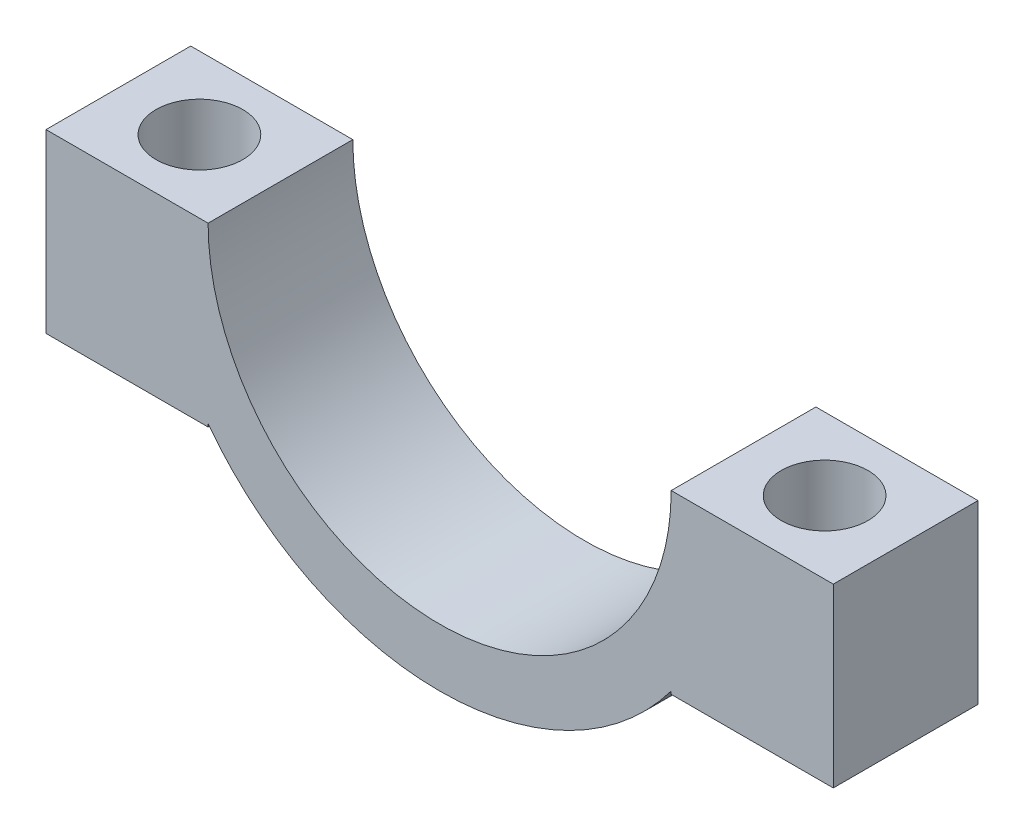
ISO-10303-21;
HEADER;
FILE_DESCRIPTION(('STEP AP214'),'2;1');
FILE_NAME('part.step','',(''),(''),'','','');
FILE_SCHEMA(('AUTOMOTIVE_DESIGN { 1 0 10303 214 1 1 1 1 }'));
ENDSEC;
DATA;
#1=APPLICATION_CONTEXT('core data for automotive mechanical design processes');
#2=APPLICATION_PROTOCOL_DEFINITION('international standard','automotive_design',2000,#1);
#3=PRODUCT_CONTEXT('',#1,'mechanical');
#4=PRODUCT('Part','Part','',(#3));
#5=PRODUCT_RELATED_PRODUCT_CATEGORY('part','',(#4));
#6=PRODUCT_DEFINITION_FORMATION('','',#4);
#7=PRODUCT_DEFINITION_CONTEXT('part definition',#1,'design');
#8=PRODUCT_DEFINITION('design','',#6,#7);
#9=PRODUCT_DEFINITION_SHAPE('','',#8);
#10=(LENGTH_UNIT() NAMED_UNIT(*) SI_UNIT(.MILLI.,.METRE.));
#11=(NAMED_UNIT(*) PLANE_ANGLE_UNIT() SI_UNIT($,.RADIAN.));
#12=(NAMED_UNIT(*) SI_UNIT($,.STERADIAN.) SOLID_ANGLE_UNIT());
#13=UNCERTAINTY_MEASURE_WITH_UNIT(LENGTH_MEASURE(1.E-05),#10,'distance_accuracy_value','');
#14=(GEOMETRIC_REPRESENTATION_CONTEXT(3) GLOBAL_UNCERTAINTY_ASSIGNED_CONTEXT((#13)) GLOBAL_UNIT_ASSIGNED_CONTEXT((#10,
#11,#12)) REPRESENTATION_CONTEXT('',''));
#15=CARTESIAN_POINT('',(0.,0.,0.));
#16=DIRECTION('',(0.,0.,1.));
#17=DIRECTION('',(1.,0.,0.));
#18=AXIS2_PLACEMENT_3D('',#15,#16,#17);
#19=CARTESIAN_POINT('',(-8.,0.,5.));
#20=DIRECTION('',(1.,0.,0.));
#21=DIRECTION('',(0.,1.,0.));
#22=AXIS2_PLACEMENT_3D('',#19,#20,#21);
#23=PLANE('',#22);
#24=DIRECTION('',(0.,-1.,0.));
#25=VECTOR('',#24,1.);
#26=CARTESIAN_POINT('',(-8.,0.,0.));
#27=LINE('',#26,#25);
#28=CARTESIAN_POINT('',(-8.,-6.00000000000001,0.));
#29=VERTEX_POINT('',#28);
#30=CARTESIAN_POINT('',(-8.,-6.1,0.));
#31=VERTEX_POINT('',#30);
#32=EDGE_CURVE('E145',#29,#31,#27,.T.);
#33=ORIENTED_EDGE('',*,*,#32,.F.);
#34=DIRECTION('',(0.,0.,-1.));
#35=VECTOR('',#34,1.);
#36=CARTESIAN_POINT('',(-8.,-6.00000000000001,5.));
#37=LINE('',#36,#35);
#38=CARTESIAN_POINT('',(-8.,-6.00000000000001,5.));
#39=VERTEX_POINT('',#38);
#40=EDGE_CURVE('E12',#39,#29,#37,.T.);
#41=ORIENTED_EDGE('',*,*,#40,.F.);
#42=DIRECTION('',(0.,-1.,0.));
#43=VECTOR('',#42,1.);
#44=CARTESIAN_POINT('',(-8.,0.,5.));
#45=LINE('',#44,#43);
#46=CARTESIAN_POINT('',(-8.,-6.1,5.));
#47=VERTEX_POINT('',#46);
#48=EDGE_CURVE('E170',#39,#47,#45,.T.);
#49=ORIENTED_EDGE('',*,*,#48,.T.);
#50=DIRECTION('',(0.,0.,-1.));
#51=VECTOR('',#50,1.);
#52=CARTESIAN_POINT('',(-8.,-6.1,5.));
#53=LINE('',#52,#51);
#54=EDGE_CURVE('E97',#47,#31,#53,.T.);
#55=ORIENTED_EDGE('',*,*,#54,.T.);
#56=EDGE_LOOP('',(#33,#41,#49,#55));
#57=FACE_BOUND('',#56,.T.);
#58=ADVANCED_FACE('F38',(#57),#23,.T.);
#59=CARTESIAN_POINT('',(0.,0.,5.));
#60=DIRECTION('',(0.,0.,-1.));
#61=DIRECTION('',(-1.,0.,0.));
#62=AXIS2_PLACEMENT_3D('',#59,#60,#61);
#63=CYLINDRICAL_SURFACE('',#62,10.);
#64=CARTESIAN_POINT('',(0.,0.,0.));
#65=DIRECTION('',(0.,0.,1.));
#66=DIRECTION('',(1.,0.,0.));
#67=AXIS2_PLACEMENT_3D('',#64,#65,#66);
#68=CIRCLE('',#67,10.);
#69=CARTESIAN_POINT('',(8.,-6.,0.));
#70=VERTEX_POINT('',#69);
#71=EDGE_CURVE('E148',#29,#70,#68,.T.);
#72=ORIENTED_EDGE('',*,*,#71,.T.);
#73=DIRECTION('',(0.,0.,-1.));
#74=VECTOR('',#73,1.);
#75=CARTESIAN_POINT('',(8.,-6.,5.));
#76=LINE('',#75,#74);
#77=CARTESIAN_POINT('',(8.,-6.,5.));
#78=VERTEX_POINT('',#77);
#79=EDGE_CURVE('E48',#78,#70,#76,.T.);
#80=ORIENTED_EDGE('',*,*,#79,.F.);
#81=CARTESIAN_POINT('',(0.,0.,5.));
#82=DIRECTION('',(0.,0.,1.));
#83=DIRECTION('',(1.,0.,0.));
#84=AXIS2_PLACEMENT_3D('',#81,#82,#83);
#85=CIRCLE('',#84,10.);
#86=EDGE_CURVE('E207',#39,#78,#85,.T.);
#87=ORIENTED_EDGE('',*,*,#86,.F.);
#88=ORIENTED_EDGE('',*,*,#40,.T.);
#89=EDGE_LOOP('',(#72,#80,#87,#88));
#90=FACE_BOUND('',#89,.T.);
#91=ADVANCED_FACE('F248',(#90),#63,.T.);
#92=CARTESIAN_POINT('',(8.,0.,5.));
#93=DIRECTION('',(1.,0.,0.));
#94=DIRECTION('',(0.,0.,-1.));
#95=AXIS2_PLACEMENT_3D('',#92,#93,#94);
#96=PLANE('',#95);
#97=DIRECTION('',(0.,-1.,0.));
#98=VECTOR('',#97,1.);
#99=CARTESIAN_POINT('',(8.,0.,0.));
#100=LINE('',#99,#98);
#101=CARTESIAN_POINT('',(8.,-6.1,0.));
#102=VERTEX_POINT('',#101);
#103=EDGE_CURVE('E151',#70,#102,#100,.T.);
#104=ORIENTED_EDGE('',*,*,#103,.T.);
#105=DIRECTION('',(0.,0.,-1.));
#106=VECTOR('',#105,1.);
#107=CARTESIAN_POINT('',(8.,-6.1,5.));
#108=LINE('',#107,#106);
#109=CARTESIAN_POINT('',(8.,-6.1,5.));
#110=VERTEX_POINT('',#109);
#111=EDGE_CURVE('E180',#110,#102,#108,.T.);
#112=ORIENTED_EDGE('',*,*,#111,.F.);
#113=DIRECTION('',(0.,-1.,0.));
#114=VECTOR('',#113,1.);
#115=CARTESIAN_POINT('',(8.,0.,5.));
#116=LINE('',#115,#114);
#117=EDGE_CURVE('E189',#78,#110,#116,.T.);
#118=ORIENTED_EDGE('',*,*,#117,.F.);
#119=ORIENTED_EDGE('',*,*,#79,.T.);
#120=EDGE_LOOP('',(#104,#112,#118,#119));
#121=FACE_BOUND('',#120,.T.);
#122=ADVANCED_FACE('F187',(#121),#96,.F.);
#123=CARTESIAN_POINT('',(0.,-6.1,5.));
#124=DIRECTION('',(0.,-1.,0.));
#125=DIRECTION('',(1.,0.,0.));
#126=AXIS2_PLACEMENT_3D('',#123,#124,#125);
#127=PLANE('',#126);
#128=CARTESIAN_POINT('',(10.8,-6.1,2.5));
#129=DIRECTION('',(0.,-1.,0.));
#130=DIRECTION('',(1.,0.,0.));
#131=AXIS2_PLACEMENT_3D('',#128,#129,#130);
#132=CIRCLE('',#131,1.5);
#133=CARTESIAN_POINT('',(12.3,-6.1,2.5));
#134=VERTEX_POINT('',#133);
#135=EDGE_CURVE('E149',#134,#134,#132,.T.);
#136=ORIENTED_EDGE('',*,*,#135,.F.);
#137=EDGE_LOOP('',(#136));
#138=FACE_BOUND('',#137,.T.);
#139=DIRECTION('',(-1.,0.,0.));
#140=VECTOR('',#139,1.);
#141=CARTESIAN_POINT('',(0.,-6.1,0.));
#142=LINE('',#141,#140);
#143=CARTESIAN_POINT('',(13.6,-6.1,0.));
#144=VERTEX_POINT('',#143);
#145=EDGE_CURVE('E154',#144,#102,#142,.T.);
#146=ORIENTED_EDGE('',*,*,#145,.F.);
#147=DIRECTION('',(0.,0.,-1.));
#148=VECTOR('',#147,1.);
#149=CARTESIAN_POINT('',(13.6,-6.1,5.));
#150=LINE('',#149,#148);
#151=CARTESIAN_POINT('',(13.6,-6.1,5.));
#152=VERTEX_POINT('',#151);
#153=EDGE_CURVE('E178',#152,#144,#150,.T.);
#154=ORIENTED_EDGE('',*,*,#153,.F.);
#155=DIRECTION('',(-1.,0.,0.));
#156=VECTOR('',#155,1.);
#157=CARTESIAN_POINT('',(0.,-6.1,5.));
#158=LINE('',#157,#156);
#159=EDGE_CURVE('E200',#152,#110,#158,.T.);
#160=ORIENTED_EDGE('',*,*,#159,.T.);
#161=ORIENTED_EDGE('',*,*,#111,.T.);
#162=EDGE_LOOP('',(#146,#154,#160,#161));
#163=FACE_BOUND('',#162,.T.);
#164=ADVANCED_FACE('F197',(#138,#163),#127,.T.);
#165=CARTESIAN_POINT('',(13.6,0.,5.));
#166=DIRECTION('',(1.,0.,0.));
#167=DIRECTION('',(0.,0.,-1.));
#168=AXIS2_PLACEMENT_3D('',#165,#166,#167);
#169=PLANE('',#168);
#170=DIRECTION('',(0.,-1.,0.));
#171=VECTOR('',#170,1.);
#172=CARTESIAN_POINT('',(13.6,0.,0.));
#173=LINE('',#172,#171);
#174=CARTESIAN_POINT('',(13.6,0.,0.));
#175=VERTEX_POINT('',#174);
#176=EDGE_CURVE('E157',#175,#144,#173,.T.);
#177=ORIENTED_EDGE('',*,*,#176,.F.);
#178=DIRECTION('',(0.,0.,-1.));
#179=VECTOR('',#178,1.);
#180=CARTESIAN_POINT('',(13.6,0.,5.));
#181=LINE('',#180,#179);
#182=CARTESIAN_POINT('',(13.6,0.,5.));
#183=VERTEX_POINT('',#182);
#184=EDGE_CURVE('E176',#183,#175,#181,.T.);
#185=ORIENTED_EDGE('',*,*,#184,.F.);
#186=DIRECTION('',(0.,-1.,0.));
#187=VECTOR('',#186,1.);
#188=CARTESIAN_POINT('',(13.6,0.,5.));
#189=LINE('',#188,#187);
#190=EDGE_CURVE('E203',#183,#152,#189,.T.);
#191=ORIENTED_EDGE('',*,*,#190,.T.);
#192=ORIENTED_EDGE('',*,*,#153,.T.);
#193=EDGE_LOOP('',(#177,#185,#191,#192));
#194=FACE_BOUND('',#193,.T.);
#195=ADVANCED_FACE('F259',(#194),#169,.T.);
#196=CARTESIAN_POINT('',(0.,0.,5.));
#197=DIRECTION('',(0.,1.,0.));
#198=DIRECTION('',(0.,0.,1.));
#199=AXIS2_PLACEMENT_3D('',#196,#197,#198);
#200=PLANE('',#199);
#201=CARTESIAN_POINT('',(10.8,0.,2.5));
#202=DIRECTION('',(0.,1.,0.));
#203=DIRECTION('',(-1.,0.,0.));
#204=AXIS2_PLACEMENT_3D('',#201,#202,#203);
#205=CIRCLE('',#204,1.5);
#206=CARTESIAN_POINT('',(9.3,0.,2.5));
#207=VERTEX_POINT('',#206);
#208=EDGE_CURVE('E224',#207,#207,#205,.T.);
#209=ORIENTED_EDGE('',*,*,#208,.F.);
#210=EDGE_LOOP('',(#209));
#211=FACE_BOUND('',#210,.T.);
#212=DIRECTION('',(1.,0.,0.));
#213=VECTOR('',#212,1.);
#214=CARTESIAN_POINT('',(0.,0.,0.));
#215=LINE('',#214,#213);
#216=CARTESIAN_POINT('',(8.,0.,0.));
#217=VERTEX_POINT('',#216);
#218=EDGE_CURVE('E160',#217,#175,#215,.T.);
#219=ORIENTED_EDGE('',*,*,#218,.F.);
#220=DIRECTION('',(0.,0.,-1.));
#221=VECTOR('',#220,1.);
#222=CARTESIAN_POINT('',(8.,0.,5.));
#223=LINE('',#222,#221);
#224=CARTESIAN_POINT('',(8.,0.,5.));
#225=VERTEX_POINT('',#224);
#226=EDGE_CURVE('E174',#225,#217,#223,.T.);
#227=ORIENTED_EDGE('',*,*,#226,.F.);
#228=DIRECTION('',(1.,0.,0.));
#229=VECTOR('',#228,1.);
#230=CARTESIAN_POINT('',(0.,0.,5.));
#231=LINE('',#230,#229);
#232=EDGE_CURVE('E205',#225,#183,#231,.T.);
#233=ORIENTED_EDGE('',*,*,#232,.T.);
#234=ORIENTED_EDGE('',*,*,#184,.T.);
#235=EDGE_LOOP('',(#219,#227,#233,#234));
#236=FACE_BOUND('',#235,.T.);
#237=ADVANCED_FACE('F263',(#211,#236),#200,.T.);
#238=CARTESIAN_POINT('',(0.,0.,5.));
#239=DIRECTION('',(0.,0.,-1.));
#240=DIRECTION('',(-1.,0.,0.));
#241=AXIS2_PLACEMENT_3D('',#238,#239,#240);
#242=CYLINDRICAL_SURFACE('',#241,8.);
#243=CARTESIAN_POINT('',(0.,0.,0.));
#244=DIRECTION('',(0.,0.,1.));
#245=DIRECTION('',(1.,0.,0.));
#246=AXIS2_PLACEMENT_3D('',#243,#244,#245);
#247=CIRCLE('',#246,8.);
#248=CARTESIAN_POINT('',(-8.,0.,0.));
#249=VERTEX_POINT('',#248);
#250=EDGE_CURVE('E163',#249,#217,#247,.T.);
#251=ORIENTED_EDGE('',*,*,#250,.F.);
#252=DIRECTION('',(0.,0.,-1.));
#253=VECTOR('',#252,1.);
#254=CARTESIAN_POINT('',(-8.,0.,5.));
#255=LINE('',#254,#253);
#256=CARTESIAN_POINT('',(-8.,0.,5.));
#257=VERTEX_POINT('',#256);
#258=EDGE_CURVE('E137',#257,#249,#255,.T.);
#259=ORIENTED_EDGE('',*,*,#258,.F.);
#260=CARTESIAN_POINT('',(0.,0.,5.));
#261=DIRECTION('',(0.,0.,1.));
#262=DIRECTION('',(1.,0.,0.));
#263=AXIS2_PLACEMENT_3D('',#260,#261,#262);
#264=CIRCLE('',#263,8.);
#265=EDGE_CURVE('E130',#257,#225,#264,.T.);
#266=ORIENTED_EDGE('',*,*,#265,.T.);
#267=ORIENTED_EDGE('',*,*,#226,.T.);
#268=EDGE_LOOP('',(#251,#259,#266,#267));
#269=FACE_BOUND('',#268,.T.);
#270=ADVANCED_FACE('F214',(#269),#242,.F.);
#271=CARTESIAN_POINT('',(0.,0.,5.));
#272=DIRECTION('',(0.,-1.,0.));
#273=DIRECTION('',(1.,0.,0.));
#274=AXIS2_PLACEMENT_3D('',#271,#272,#273);
#275=PLANE('',#274);
#276=CARTESIAN_POINT('',(-10.8,0.,2.5));
#277=DIRECTION('',(0.,1.,0.));
#278=DIRECTION('',(-1.,0.,0.));
#279=AXIS2_PLACEMENT_3D('',#276,#277,#278);
#280=CIRCLE('',#279,1.5);
#281=CARTESIAN_POINT('',(-12.3,0.,2.5));
#282=VERTEX_POINT('',#281);
#283=EDGE_CURVE('E230',#282,#282,#280,.T.);
#284=ORIENTED_EDGE('',*,*,#283,.F.);
#285=EDGE_LOOP('',(#284));
#286=FACE_BOUND('',#285,.T.);
#287=DIRECTION('',(-1.,0.,0.));
#288=VECTOR('',#287,1.);
#289=CARTESIAN_POINT('',(0.,0.,0.));
#290=LINE('',#289,#288);
#291=CARTESIAN_POINT('',(-13.6,0.,0.));
#292=VERTEX_POINT('',#291);
#293=EDGE_CURVE('E136',#249,#292,#290,.T.);
#294=ORIENTED_EDGE('',*,*,#293,.T.);
#295=DIRECTION('',(0.,0.,-1.));
#296=VECTOR('',#295,1.);
#297=CARTESIAN_POINT('',(-13.6,0.,5.));
#298=LINE('',#297,#296);
#299=CARTESIAN_POINT('',(-13.6,0.,5.));
#300=VERTEX_POINT('',#299);
#301=EDGE_CURVE('E133',#300,#292,#298,.T.);
#302=ORIENTED_EDGE('',*,*,#301,.F.);
#303=DIRECTION('',(-1.,0.,0.));
#304=VECTOR('',#303,1.);
#305=CARTESIAN_POINT('',(0.,0.,5.));
#306=LINE('',#305,#304);
#307=EDGE_CURVE('E123',#257,#300,#306,.T.);
#308=ORIENTED_EDGE('',*,*,#307,.F.);
#309=ORIENTED_EDGE('',*,*,#258,.T.);
#310=EDGE_LOOP('',(#294,#302,#308,#309));
#311=FACE_BOUND('',#310,.T.);
#312=ADVANCED_FACE('F134',(#286,#311),#275,.F.);
#313=CARTESIAN_POINT('',(-13.6,0.,5.));
#314=DIRECTION('',(1.,0.,0.));
#315=DIRECTION('',(0.,0.,-1.));
#316=AXIS2_PLACEMENT_3D('',#313,#314,#315);
#317=PLANE('',#316);
#318=DIRECTION('',(0.,-1.,0.));
#319=VECTOR('',#318,1.);
#320=CARTESIAN_POINT('',(-13.6,0.,0.));
#321=LINE('',#320,#319);
#322=CARTESIAN_POINT('',(-13.6,-6.1,0.));
#323=VERTEX_POINT('',#322);
#324=EDGE_CURVE('E90',#292,#323,#321,.T.);
#325=ORIENTED_EDGE('',*,*,#324,.T.);
#326=DIRECTION('',(0.,0.,-1.));
#327=VECTOR('',#326,1.);
#328=CARTESIAN_POINT('',(-13.6,-6.1,5.));
#329=LINE('',#328,#327);
#330=CARTESIAN_POINT('',(-13.6,-6.1,5.));
#331=VERTEX_POINT('',#330);
#332=EDGE_CURVE('E138',#331,#323,#329,.T.);
#333=ORIENTED_EDGE('',*,*,#332,.F.);
#334=DIRECTION('',(0.,-1.,0.));
#335=VECTOR('',#334,1.);
#336=CARTESIAN_POINT('',(-13.6,0.,5.));
#337=LINE('',#336,#335);
#338=EDGE_CURVE('E127',#300,#331,#337,.T.);
#339=ORIENTED_EDGE('',*,*,#338,.F.);
#340=ORIENTED_EDGE('',*,*,#301,.T.);
#341=EDGE_LOOP('',(#325,#333,#339,#340));
#342=FACE_BOUND('',#341,.T.);
#343=ADVANCED_FACE('F140',(#342),#317,.F.);
#344=CARTESIAN_POINT('',(0.,-6.1,5.));
#345=DIRECTION('',(0.,1.,0.));
#346=DIRECTION('',(0.,0.,1.));
#347=AXIS2_PLACEMENT_3D('',#344,#345,#346);
#348=PLANE('',#347);
#349=CARTESIAN_POINT('',(-10.8,-6.1,2.5));
#350=DIRECTION('',(0.,1.,0.));
#351=DIRECTION('',(0.,0.,1.));
#352=AXIS2_PLACEMENT_3D('',#349,#350,#351);
#353=CIRCLE('',#352,1.5);
#354=CARTESIAN_POINT('',(-10.8,-6.1,4.));
#355=VERTEX_POINT('',#354);
#356=EDGE_CURVE('E41',#355,#355,#353,.T.);
#357=ORIENTED_EDGE('',*,*,#356,.T.);
#358=EDGE_LOOP('',(#357));
#359=FACE_BOUND('',#358,.T.);
#360=DIRECTION('',(1.,0.,0.));
#361=VECTOR('',#360,1.);
#362=CARTESIAN_POINT('',(0.,-6.1,0.));
#363=LINE('',#362,#361);
#364=EDGE_CURVE('E168',#323,#31,#363,.T.);
#365=ORIENTED_EDGE('',*,*,#364,.T.);
#366=ORIENTED_EDGE('',*,*,#54,.F.);
#367=DIRECTION('',(1.,0.,0.));
#368=VECTOR('',#367,1.);
#369=CARTESIAN_POINT('',(0.,-6.1,5.));
#370=LINE('',#369,#368);
#371=EDGE_CURVE('E56',#331,#47,#370,.T.);
#372=ORIENTED_EDGE('',*,*,#371,.F.);
#373=ORIENTED_EDGE('',*,*,#332,.T.);
#374=EDGE_LOOP('',(#365,#366,#372,#373));
#375=FACE_BOUND('',#374,.T.);
#376=ADVANCED_FACE('F218',(#359,#375),#348,.F.);
#377=CARTESIAN_POINT('',(0.,0.,5.));
#378=DIRECTION('',(0.,0.,1.));
#379=DIRECTION('',(1.,0.,0.));
#380=AXIS2_PLACEMENT_3D('',#377,#378,#379);
#381=PLANE('',#380);
#382=ORIENTED_EDGE('',*,*,#48,.F.);
#383=ORIENTED_EDGE('',*,*,#86,.T.);
#384=ORIENTED_EDGE('',*,*,#117,.T.);
#385=ORIENTED_EDGE('',*,*,#159,.F.);
#386=ORIENTED_EDGE('',*,*,#190,.F.);
#387=ORIENTED_EDGE('',*,*,#232,.F.);
#388=ORIENTED_EDGE('',*,*,#265,.F.);
#389=ORIENTED_EDGE('',*,*,#307,.T.);
#390=ORIENTED_EDGE('',*,*,#338,.T.);
#391=ORIENTED_EDGE('',*,*,#371,.T.);
#392=EDGE_LOOP('',(#382,#383,#384,#385,#386,#387,#388,#389,#390,#391));
#393=FACE_BOUND('',#392,.T.);
#394=ADVANCED_FACE('F125',(#393),#381,.T.);
#395=CARTESIAN_POINT('',(0.,0.,0.));
#396=DIRECTION('',(0.,0.,1.));
#397=DIRECTION('',(1.,0.,0.));
#398=AXIS2_PLACEMENT_3D('',#395,#396,#397);
#399=PLANE('',#398);
#400=ORIENTED_EDGE('',*,*,#32,.T.);
#401=ORIENTED_EDGE('',*,*,#364,.F.);
#402=ORIENTED_EDGE('',*,*,#324,.F.);
#403=ORIENTED_EDGE('',*,*,#293,.F.);
#404=ORIENTED_EDGE('',*,*,#250,.T.);
#405=ORIENTED_EDGE('',*,*,#218,.T.);
#406=ORIENTED_EDGE('',*,*,#176,.T.);
#407=ORIENTED_EDGE('',*,*,#145,.T.);
#408=ORIENTED_EDGE('',*,*,#103,.F.);
#409=ORIENTED_EDGE('',*,*,#71,.F.);
#410=EDGE_LOOP('',(#400,#401,#402,#403,#404,#405,#406,#407,#408,#409));
#411=FACE_BOUND('',#410,.T.);
#412=ADVANCED_FACE('F193',(#411),#399,.F.);
#413=CARTESIAN_POINT('',(10.8,-10.,2.5));
#414=DIRECTION('',(0.,1.,0.));
#415=DIRECTION('',(-1.,0.,0.));
#416=AXIS2_PLACEMENT_3D('',#413,#414,#415);
#417=CYLINDRICAL_SURFACE('',#416,1.5);
#418=ORIENTED_EDGE('',*,*,#135,.T.);
#419=EDGE_LOOP('',(#418));
#420=FACE_BOUND('',#419,.T.);
#421=ORIENTED_EDGE('',*,*,#208,.T.);
#422=EDGE_LOOP('',(#421));
#423=FACE_BOUND('',#422,.T.);
#424=ADVANCED_FACE('F240',(#420,#423),#417,.F.);
#425=CARTESIAN_POINT('',(-10.8,-10.,2.5));
#426=DIRECTION('',(0.,1.,0.));
#427=DIRECTION('',(-1.,0.,0.));
#428=AXIS2_PLACEMENT_3D('',#425,#426,#427);
#429=CYLINDRICAL_SURFACE('',#428,1.5);
#430=ORIENTED_EDGE('',*,*,#283,.T.);
#431=EDGE_LOOP('',(#430));
#432=FACE_BOUND('',#431,.T.);
#433=ORIENTED_EDGE('',*,*,#356,.F.);
#434=EDGE_LOOP('',(#433));
#435=FACE_BOUND('',#434,.T.);
#436=ADVANCED_FACE('F238',(#432,#435),#429,.F.);
#437=CLOSED_SHELL('',(#58,#91,#122,#164,#195,#237,#270,#312,#343,#376,#394,#412,#424,#436));
#438=MANIFOLD_SOLID_BREP('B2',#437);
#439=ADVANCED_BREP_SHAPE_REPRESENTATION('',(#18,#438),#14);
#440=SHAPE_DEFINITION_REPRESENTATION(#9,#439);
ENDSEC;
END-ISO-10303-21;
